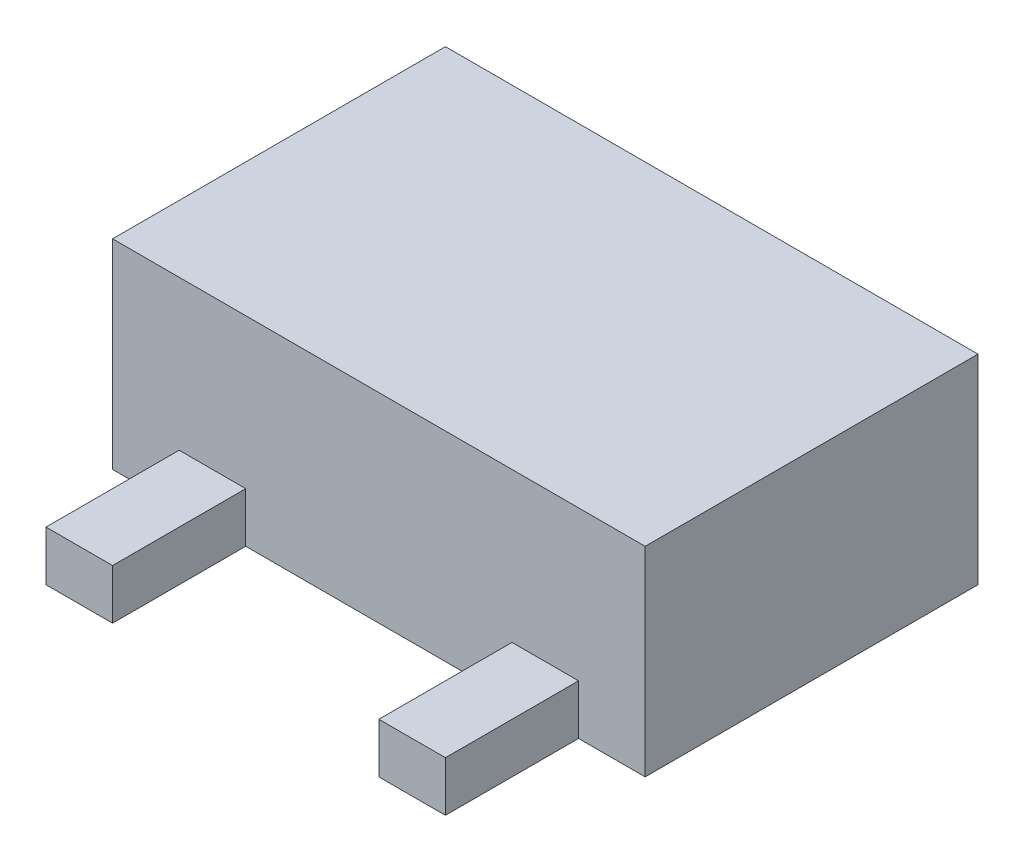
ISO-10303-21;
HEADER;
FILE_DESCRIPTION(('STEP AP214'),'2;1');
FILE_NAME('part.step','',(''),(''),'','','');
FILE_SCHEMA(('AUTOMOTIVE_DESIGN { 1 0 10303 214 1 1 1 1 }'));
ENDSEC;
DATA;
#1=APPLICATION_CONTEXT('core data for automotive mechanical design processes');
#2=APPLICATION_PROTOCOL_DEFINITION('international standard','automotive_design',2000,#1);
#3=PRODUCT_CONTEXT('',#1,'mechanical');
#4=PRODUCT('Part','Part','',(#3));
#5=PRODUCT_RELATED_PRODUCT_CATEGORY('part','',(#4));
#6=PRODUCT_DEFINITION_FORMATION('','',#4);
#7=PRODUCT_DEFINITION_CONTEXT('part definition',#1,'design');
#8=PRODUCT_DEFINITION('design','',#6,#7);
#9=PRODUCT_DEFINITION_SHAPE('','',#8);
#10=(LENGTH_UNIT() NAMED_UNIT(*) SI_UNIT(.MILLI.,.METRE.));
#11=(NAMED_UNIT(*) PLANE_ANGLE_UNIT() SI_UNIT($,.RADIAN.));
#12=(NAMED_UNIT(*) SI_UNIT($,.STERADIAN.) SOLID_ANGLE_UNIT());
#13=UNCERTAINTY_MEASURE_WITH_UNIT(LENGTH_MEASURE(1.E-05),#10,'distance_accuracy_value','');
#14=(GEOMETRIC_REPRESENTATION_CONTEXT(3) GLOBAL_UNCERTAINTY_ASSIGNED_CONTEXT((#13)) GLOBAL_UNIT_ASSIGNED_CONTEXT((#10,
#11,#12)) REPRESENTATION_CONTEXT('',''));
#15=CARTESIAN_POINT('',(0.,0.,0.));
#16=DIRECTION('',(0.,0.,1.));
#17=DIRECTION('',(1.,0.,0.));
#18=AXIS2_PLACEMENT_3D('',#15,#16,#17);
#19=CARTESIAN_POINT('',(-0.8,0.6,0.5));
#20=DIRECTION('',(0.,0.,-1.));
#21=DIRECTION('',(-1.,0.,0.));
#22=AXIS2_PLACEMENT_3D('',#19,#20,#21);
#23=PLANE('',#22);
#24=DIRECTION('',(-1.,0.,0.));
#25=VECTOR('',#24,1.);
#26=CARTESIAN_POINT('',(0.6,0.15,0.5));
#27=LINE('',#26,#25);
#28=CARTESIAN_POINT('',(0.6,0.15,0.5));
#29=VERTEX_POINT('',#28);
#30=CARTESIAN_POINT('',(0.4,0.15,0.5));
#31=VERTEX_POINT('',#30);
#32=EDGE_CURVE('E64',#29,#31,#27,.T.);
#33=ORIENTED_EDGE('',*,*,#32,.F.);
#34=DIRECTION('',(0.,-1.,0.));
#35=VECTOR('',#34,1.);
#36=CARTESIAN_POINT('',(0.6,0.597213595499958,0.5));
#37=LINE('',#36,#35);
#38=CARTESIAN_POINT('',(0.6,0.,0.5));
#39=VERTEX_POINT('',#38);
#40=EDGE_CURVE('E172',#29,#39,#37,.T.);
#41=ORIENTED_EDGE('',*,*,#40,.T.);
#42=DIRECTION('',(1.,0.,0.));
#43=VECTOR('',#42,1.);
#44=CARTESIAN_POINT('',(-0.8,0.,0.5));
#45=LINE('',#44,#43);
#46=CARTESIAN_POINT('',(0.8,0.,0.5));
#47=VERTEX_POINT('',#46);
#48=EDGE_CURVE('E157',#39,#47,#45,.T.);
#49=ORIENTED_EDGE('',*,*,#48,.T.);
#50=DIRECTION('',(0.,-1.,0.));
#51=VECTOR('',#50,1.);
#52=CARTESIAN_POINT('',(0.8,0.6,0.5));
#53=LINE('',#52,#51);
#54=CARTESIAN_POINT('',(0.8,0.6,0.5));
#55=VERTEX_POINT('',#54);
#56=EDGE_CURVE('E259',#55,#47,#53,.T.);
#57=ORIENTED_EDGE('',*,*,#56,.F.);
#58=DIRECTION('',(1.,0.,0.));
#59=VECTOR('',#58,1.);
#60=CARTESIAN_POINT('',(-0.8,0.6,0.5));
#61=LINE('',#60,#59);
#62=CARTESIAN_POINT('',(-0.8,0.6,0.5));
#63=VERTEX_POINT('',#62);
#64=EDGE_CURVE('E257',#63,#55,#61,.T.);
#65=ORIENTED_EDGE('',*,*,#64,.F.);
#66=DIRECTION('',(0.,-1.,0.));
#67=VECTOR('',#66,1.);
#68=CARTESIAN_POINT('',(-0.8,0.6,0.5));
#69=LINE('',#68,#67);
#70=CARTESIAN_POINT('',(-0.8,0.,0.5));
#71=VERTEX_POINT('',#70);
#72=EDGE_CURVE('E268',#63,#71,#69,.T.);
#73=ORIENTED_EDGE('',*,*,#72,.T.);
#74=CARTESIAN_POINT('',(-0.6,0.,0.5));
#75=VERTEX_POINT('',#74);
#76=EDGE_CURVE('E170',#71,#75,#45,.T.);
#77=ORIENTED_EDGE('',*,*,#76,.T.);
#78=DIRECTION('',(0.,-1.,0.));
#79=VECTOR('',#78,1.);
#80=CARTESIAN_POINT('',(-0.6,0.597213595499958,0.5));
#81=LINE('',#80,#79);
#82=CARTESIAN_POINT('',(-0.6,0.15,0.5));
#83=VERTEX_POINT('',#82);
#84=EDGE_CURVE('E215',#83,#75,#81,.T.);
#85=ORIENTED_EDGE('',*,*,#84,.F.);
#86=DIRECTION('',(1.,0.,0.));
#87=VECTOR('',#86,1.);
#88=CARTESIAN_POINT('',(-0.6,0.15,0.5));
#89=LINE('',#88,#87);
#90=CARTESIAN_POINT('',(-0.4,0.15,0.5));
#91=VERTEX_POINT('',#90);
#92=EDGE_CURVE('E201',#83,#91,#89,.T.);
#93=ORIENTED_EDGE('',*,*,#92,.T.);
#94=DIRECTION('',(0.,-1.,0.));
#95=VECTOR('',#94,1.);
#96=CARTESIAN_POINT('',(-0.4,0.597213595499958,0.5));
#97=LINE('',#96,#95);
#98=CARTESIAN_POINT('',(-0.4,0.,0.5));
#99=VERTEX_POINT('',#98);
#100=EDGE_CURVE('E217',#91,#99,#97,.T.);
#101=ORIENTED_EDGE('',*,*,#100,.T.);
#102=CARTESIAN_POINT('',(0.4,0.,0.5));
#103=VERTEX_POINT('',#102);
#104=EDGE_CURVE('E167',#99,#103,#45,.T.);
#105=ORIENTED_EDGE('',*,*,#104,.T.);
#106=DIRECTION('',(0.,-1.,0.));
#107=VECTOR('',#106,1.);
#108=CARTESIAN_POINT('',(0.4,0.597213595499958,0.5));
#109=LINE('',#108,#107);
#110=EDGE_CURVE('E60',#31,#103,#109,.T.);
#111=ORIENTED_EDGE('',*,*,#110,.F.);
#112=EDGE_LOOP('',(#33,#41,#49,#57,#65,#73,#77,#85,#93,#101,#105,#111));
#113=FACE_BOUND('',#112,.T.);
#114=ADVANCED_FACE('F45',(#113),#23,.F.);
#115=CARTESIAN_POINT('',(-0.8,0.6,-0.5));
#116=DIRECTION('',(0.,0.,1.));
#117=DIRECTION('',(1.,0.,0.));
#118=AXIS2_PLACEMENT_3D('',#115,#116,#117);
#119=PLANE('',#118);
#120=DIRECTION('',(0.,-1.,0.));
#121=VECTOR('',#120,1.);
#122=CARTESIAN_POINT('',(0.1,0.15,-0.500000000000001));
#123=LINE('',#122,#121);
#124=CARTESIAN_POINT('',(0.1,0.15,-0.500000000000001));
#125=VERTEX_POINT('',#124);
#126=CARTESIAN_POINT('',(0.1,0.,-0.500000000000001));
#127=VERTEX_POINT('',#126);
#128=EDGE_CURVE('E245',#125,#127,#123,.T.);
#129=ORIENTED_EDGE('',*,*,#128,.F.);
#130=DIRECTION('',(1.,0.,0.));
#131=VECTOR('',#130,1.);
#132=CARTESIAN_POINT('',(-0.1,0.15,-0.500000000000001));
#133=LINE('',#132,#131);
#134=CARTESIAN_POINT('',(-0.1,0.15,-0.500000000000001));
#135=VERTEX_POINT('',#134);
#136=EDGE_CURVE('E228',#135,#125,#133,.T.);
#137=ORIENTED_EDGE('',*,*,#136,.F.);
#138=DIRECTION('',(0.,-1.,0.));
#139=VECTOR('',#138,1.);
#140=CARTESIAN_POINT('',(-0.1,0.15,-0.500000000000001));
#141=LINE('',#140,#139);
#142=CARTESIAN_POINT('',(-0.1,0.,-0.5));
#143=VERTEX_POINT('',#142);
#144=EDGE_CURVE('E247',#135,#143,#141,.T.);
#145=ORIENTED_EDGE('',*,*,#144,.T.);
#146=DIRECTION('',(-1.,0.,0.));
#147=VECTOR('',#146,1.);
#148=CARTESIAN_POINT('',(-0.8,0.,-0.5));
#149=LINE('',#148,#147);
#150=CARTESIAN_POINT('',(-0.8,0.,-0.5));
#151=VERTEX_POINT('',#150);
#152=EDGE_CURVE('E261',#143,#151,#149,.T.);
#153=ORIENTED_EDGE('',*,*,#152,.T.);
#154=DIRECTION('',(0.,-1.,0.));
#155=VECTOR('',#154,1.);
#156=CARTESIAN_POINT('',(-0.8,0.6,-0.5));
#157=LINE('',#156,#155);
#158=CARTESIAN_POINT('',(-0.8,0.6,-0.5));
#159=VERTEX_POINT('',#158);
#160=EDGE_CURVE('E53',#159,#151,#157,.T.);
#161=ORIENTED_EDGE('',*,*,#160,.F.);
#162=DIRECTION('',(-1.,0.,0.));
#163=VECTOR('',#162,1.);
#164=CARTESIAN_POINT('',(-0.8,0.6,-0.5));
#165=LINE('',#164,#163);
#166=CARTESIAN_POINT('',(0.8,0.6,-0.5));
#167=VERTEX_POINT('',#166);
#168=EDGE_CURVE('E253',#167,#159,#165,.T.);
#169=ORIENTED_EDGE('',*,*,#168,.F.);
#170=DIRECTION('',(0.,-1.,0.));
#171=VECTOR('',#170,1.);
#172=CARTESIAN_POINT('',(0.8,0.6,-0.5));
#173=LINE('',#172,#171);
#174=CARTESIAN_POINT('',(0.8,0.,-0.5));
#175=VERTEX_POINT('',#174);
#176=EDGE_CURVE('E11',#167,#175,#173,.T.);
#177=ORIENTED_EDGE('',*,*,#176,.T.);
#178=EDGE_CURVE('E262',#175,#127,#149,.T.);
#179=ORIENTED_EDGE('',*,*,#178,.T.);
#180=EDGE_LOOP('',(#129,#137,#145,#153,#161,#169,#177,#179));
#181=FACE_BOUND('',#180,.T.);
#182=ADVANCED_FACE('F290',(#181),#119,.F.);
#183=CARTESIAN_POINT('',(0.8,0.6,-0.5));
#184=DIRECTION('',(-1.,0.,0.));
#185=DIRECTION('',(0.,0.,1.));
#186=AXIS2_PLACEMENT_3D('',#183,#184,#185);
#187=PLANE('',#186);
#188=DIRECTION('',(0.,0.,-1.));
#189=VECTOR('',#188,1.);
#190=CARTESIAN_POINT('',(0.8,0.,-0.5));
#191=LINE('',#190,#189);
#192=EDGE_CURVE('E164',#47,#175,#191,.T.);
#193=ORIENTED_EDGE('',*,*,#192,.T.);
#194=ORIENTED_EDGE('',*,*,#176,.F.);
#195=DIRECTION('',(0.,0.,-1.));
#196=VECTOR('',#195,1.);
#197=CARTESIAN_POINT('',(0.8,0.6,-0.5));
#198=LINE('',#197,#196);
#199=EDGE_CURVE('E250',#55,#167,#198,.T.);
#200=ORIENTED_EDGE('',*,*,#199,.F.);
#201=ORIENTED_EDGE('',*,*,#56,.T.);
#202=EDGE_LOOP('',(#193,#194,#200,#201));
#203=FACE_BOUND('',#202,.T.);
#204=ADVANCED_FACE('F47',(#203),#187,.F.);
#205=CARTESIAN_POINT('',(-0.8,0.6,-0.5));
#206=DIRECTION('',(1.,0.,0.));
#207=DIRECTION('',(0.,0.,-1.));
#208=AXIS2_PLACEMENT_3D('',#205,#206,#207);
#209=PLANE('',#208);
#210=DIRECTION('',(0.,0.,1.));
#211=VECTOR('',#210,1.);
#212=CARTESIAN_POINT('',(-0.8,0.,-0.5));
#213=LINE('',#212,#211);
#214=EDGE_CURVE('E168',#151,#71,#213,.T.);
#215=ORIENTED_EDGE('',*,*,#214,.T.);
#216=ORIENTED_EDGE('',*,*,#72,.F.);
#217=DIRECTION('',(0.,0.,1.));
#218=VECTOR('',#217,1.);
#219=CARTESIAN_POINT('',(-0.8,0.6,-0.5));
#220=LINE('',#219,#218);
#221=EDGE_CURVE('E255',#159,#63,#220,.T.);
#222=ORIENTED_EDGE('',*,*,#221,.F.);
#223=ORIENTED_EDGE('',*,*,#160,.T.);
#224=EDGE_LOOP('',(#215,#216,#222,#223));
#225=FACE_BOUND('',#224,.T.);
#226=ADVANCED_FACE('F275',(#225),#209,.F.);
#227=CARTESIAN_POINT('',(0.,0.6,0.));
#228=DIRECTION('',(0.,1.,0.));
#229=DIRECTION('',(0.,0.,1.));
#230=AXIS2_PLACEMENT_3D('',#227,#228,#229);
#231=PLANE('',#230);
#232=ORIENTED_EDGE('',*,*,#199,.T.);
#233=ORIENTED_EDGE('',*,*,#168,.T.);
#234=ORIENTED_EDGE('',*,*,#221,.T.);
#235=ORIENTED_EDGE('',*,*,#64,.T.);
#236=EDGE_LOOP('',(#232,#233,#234,#235));
#237=FACE_BOUND('',#236,.T.);
#238=ADVANCED_FACE('F287',(#237),#231,.T.);
#239=CARTESIAN_POINT('',(0.,0.,0.));
#240=DIRECTION('',(0.,1.,0.));
#241=DIRECTION('',(0.,0.,1.));
#242=AXIS2_PLACEMENT_3D('',#239,#240,#241);
#243=PLANE('',#242);
#244=ORIENTED_EDGE('',*,*,#192,.F.);
#245=ORIENTED_EDGE('',*,*,#48,.F.);
#246=DIRECTION('',(0.,0.,1.));
#247=VECTOR('',#246,1.);
#248=CARTESIAN_POINT('',(0.6,0.,0.5));
#249=LINE('',#248,#247);
#250=CARTESIAN_POINT('',(0.6,0.,0.9));
#251=VERTEX_POINT('',#250);
#252=EDGE_CURVE('E161',#39,#251,#249,.T.);
#253=ORIENTED_EDGE('',*,*,#252,.T.);
#254=DIRECTION('',(-1.,0.,0.));
#255=VECTOR('',#254,1.);
#256=CARTESIAN_POINT('',(0.6,0.,0.9));
#257=LINE('',#256,#255);
#258=CARTESIAN_POINT('',(0.4,0.,0.9));
#259=VERTEX_POINT('',#258);
#260=EDGE_CURVE('E183',#251,#259,#257,.T.);
#261=ORIENTED_EDGE('',*,*,#260,.T.);
#262=DIRECTION('',(0.,0.,-1.));
#263=VECTOR('',#262,1.);
#264=CARTESIAN_POINT('',(0.4,0.,0.5));
#265=LINE('',#264,#263);
#266=EDGE_CURVE('E180',#259,#103,#265,.T.);
#267=ORIENTED_EDGE('',*,*,#266,.T.);
#268=ORIENTED_EDGE('',*,*,#104,.F.);
#269=DIRECTION('',(0.,0.,-1.));
#270=VECTOR('',#269,1.);
#271=CARTESIAN_POINT('',(-0.4,0.,0.5));
#272=LINE('',#271,#270);
#273=CARTESIAN_POINT('',(-0.4,0.,0.9));
#274=VERTEX_POINT('',#273);
#275=EDGE_CURVE('E213',#274,#99,#272,.T.);
#276=ORIENTED_EDGE('',*,*,#275,.F.);
#277=DIRECTION('',(1.,0.,0.));
#278=VECTOR('',#277,1.);
#279=CARTESIAN_POINT('',(-0.6,0.,0.9));
#280=LINE('',#279,#278);
#281=CARTESIAN_POINT('',(-0.6,0.,0.9));
#282=VERTEX_POINT('',#281);
#283=EDGE_CURVE('E210',#282,#274,#280,.T.);
#284=ORIENTED_EDGE('',*,*,#283,.F.);
#285=DIRECTION('',(0.,0.,1.));
#286=VECTOR('',#285,1.);
#287=CARTESIAN_POINT('',(-0.6,0.,0.5));
#288=LINE('',#287,#286);
#289=EDGE_CURVE('E196',#75,#282,#288,.T.);
#290=ORIENTED_EDGE('',*,*,#289,.F.);
#291=ORIENTED_EDGE('',*,*,#76,.F.);
#292=ORIENTED_EDGE('',*,*,#214,.F.);
#293=ORIENTED_EDGE('',*,*,#152,.F.);
#294=DIRECTION('',(0.,0.,1.));
#295=VECTOR('',#294,1.);
#296=CARTESIAN_POINT('',(-0.1,0.,-0.500000000000001));
#297=LINE('',#296,#295);
#298=CARTESIAN_POINT('',(-0.1,0.,-0.900000000000001));
#299=VERTEX_POINT('',#298);
#300=EDGE_CURVE('E207',#299,#143,#297,.T.);
#301=ORIENTED_EDGE('',*,*,#300,.F.);
#302=DIRECTION('',(-1.,0.,0.));
#303=VECTOR('',#302,1.);
#304=CARTESIAN_POINT('',(-0.1,0.,-0.900000000000001));
#305=LINE('',#304,#303);
#306=CARTESIAN_POINT('',(0.1,0.,-0.9));
#307=VERTEX_POINT('',#306);
#308=EDGE_CURVE('E229',#307,#299,#305,.T.);
#309=ORIENTED_EDGE('',*,*,#308,.F.);
#310=DIRECTION('',(0.,0.,-1.));
#311=VECTOR('',#310,1.);
#312=CARTESIAN_POINT('',(0.1,0.,-0.500000000000001));
#313=LINE('',#312,#311);
#314=EDGE_CURVE('E237',#127,#307,#313,.T.);
#315=ORIENTED_EDGE('',*,*,#314,.F.);
#316=ORIENTED_EDGE('',*,*,#178,.F.);
#317=EDGE_LOOP('',(#244,#245,#253,#261,#267,#268,#276,#284,#290,#291,#292,#293,#301,#309,#315,#316));
#318=FACE_BOUND('',#317,.T.);
#319=ADVANCED_FACE('F158',(#318),#243,.F.);
#320=CARTESIAN_POINT('',(-0.1,0.15,-0.500000000000001));
#321=DIRECTION('',(1.,0.,0.));
#322=DIRECTION('',(0.,0.,-1.));
#323=AXIS2_PLACEMENT_3D('',#320,#321,#322);
#324=PLANE('',#323);
#325=ORIENTED_EDGE('',*,*,#300,.T.);
#326=ORIENTED_EDGE('',*,*,#144,.F.);
#327=DIRECTION('',(0.,0.,1.));
#328=VECTOR('',#327,1.);
#329=CARTESIAN_POINT('',(-0.1,0.15,-0.500000000000001));
#330=LINE('',#329,#328);
#331=CARTESIAN_POINT('',(-0.1,0.15,-0.900000000000001));
#332=VERTEX_POINT('',#331);
#333=EDGE_CURVE('E226',#332,#135,#330,.T.);
#334=ORIENTED_EDGE('',*,*,#333,.F.);
#335=DIRECTION('',(0.,-1.,0.));
#336=VECTOR('',#335,1.);
#337=CARTESIAN_POINT('',(-0.1,0.15,-0.900000000000001));
#338=LINE('',#337,#336);
#339=EDGE_CURVE('E235',#332,#299,#338,.T.);
#340=ORIENTED_EDGE('',*,*,#339,.T.);
#341=EDGE_LOOP('',(#325,#326,#334,#340));
#342=FACE_BOUND('',#341,.T.);
#343=ADVANCED_FACE('F305',(#342),#324,.F.);
#344=CARTESIAN_POINT('',(0.1,0.15,-0.500000000000001));
#345=DIRECTION('',(-1.,0.,0.));
#346=DIRECTION('',(0.,0.,1.));
#347=AXIS2_PLACEMENT_3D('',#344,#345,#346);
#348=PLANE('',#347);
#349=ORIENTED_EDGE('',*,*,#314,.T.);
#350=DIRECTION('',(0.,-1.,0.));
#351=VECTOR('',#350,1.);
#352=CARTESIAN_POINT('',(0.1,0.15,-0.9));
#353=LINE('',#352,#351);
#354=CARTESIAN_POINT('',(0.1,0.15,-0.9));
#355=VERTEX_POINT('',#354);
#356=EDGE_CURVE('E242',#355,#307,#353,.T.);
#357=ORIENTED_EDGE('',*,*,#356,.F.);
#358=DIRECTION('',(0.,0.,-1.));
#359=VECTOR('',#358,1.);
#360=CARTESIAN_POINT('',(0.1,0.15,-0.500000000000001));
#361=LINE('',#360,#359);
#362=EDGE_CURVE('E231',#125,#355,#361,.T.);
#363=ORIENTED_EDGE('',*,*,#362,.F.);
#364=ORIENTED_EDGE('',*,*,#128,.T.);
#365=EDGE_LOOP('',(#349,#357,#363,#364));
#366=FACE_BOUND('',#365,.T.);
#367=ADVANCED_FACE('F310',(#366),#348,.F.);
#368=CARTESIAN_POINT('',(-0.1,0.15,-0.900000000000001));
#369=DIRECTION('',(0.,0.,1.));
#370=DIRECTION('',(1.,0.,0.));
#371=AXIS2_PLACEMENT_3D('',#368,#369,#370);
#372=PLANE('',#371);
#373=ORIENTED_EDGE('',*,*,#308,.T.);
#374=ORIENTED_EDGE('',*,*,#339,.F.);
#375=DIRECTION('',(-1.,0.,0.));
#376=VECTOR('',#375,1.);
#377=CARTESIAN_POINT('',(-0.1,0.15,-0.900000000000001));
#378=LINE('',#377,#376);
#379=EDGE_CURVE('E233',#355,#332,#378,.T.);
#380=ORIENTED_EDGE('',*,*,#379,.F.);
#381=ORIENTED_EDGE('',*,*,#356,.T.);
#382=EDGE_LOOP('',(#373,#374,#380,#381));
#383=FACE_BOUND('',#382,.T.);
#384=ADVANCED_FACE('F314',(#383),#372,.F.);
#385=CARTESIAN_POINT('',(0.,0.15,0.));
#386=DIRECTION('',(0.,-1.,0.));
#387=DIRECTION('',(0.,0.,-1.));
#388=AXIS2_PLACEMENT_3D('',#385,#386,#387);
#389=PLANE('',#388);
#390=ORIENTED_EDGE('',*,*,#333,.T.);
#391=ORIENTED_EDGE('',*,*,#136,.T.);
#392=ORIENTED_EDGE('',*,*,#362,.T.);
#393=ORIENTED_EDGE('',*,*,#379,.T.);
#394=EDGE_LOOP('',(#390,#391,#392,#393));
#395=FACE_BOUND('',#394,.T.);
#396=ADVANCED_FACE('F318',(#395),#389,.F.);
#397=CARTESIAN_POINT('',(-0.4,0.597213595499958,0.5));
#398=DIRECTION('',(-1.,0.,0.));
#399=DIRECTION('',(0.,0.,1.));
#400=AXIS2_PLACEMENT_3D('',#397,#398,#399);
#401=PLANE('',#400);
#402=ORIENTED_EDGE('',*,*,#100,.F.);
#403=DIRECTION('',(0.,0.,1.));
#404=VECTOR('',#403,1.);
#405=CARTESIAN_POINT('',(-0.4,0.15,0.5));
#406=LINE('',#405,#404);
#407=CARTESIAN_POINT('',(-0.4,0.15,0.9));
#408=VERTEX_POINT('',#407);
#409=EDGE_CURVE('E197',#91,#408,#406,.T.);
#410=ORIENTED_EDGE('',*,*,#409,.T.);
#411=DIRECTION('',(0.,-1.,0.));
#412=VECTOR('',#411,1.);
#413=CARTESIAN_POINT('',(-0.4,0.597213595499958,0.9));
#414=LINE('',#413,#412);
#415=EDGE_CURVE('E220',#408,#274,#414,.T.);
#416=ORIENTED_EDGE('',*,*,#415,.T.);
#417=ORIENTED_EDGE('',*,*,#275,.T.);
#418=EDGE_LOOP('',(#402,#410,#416,#417));
#419=FACE_BOUND('',#418,.T.);
#420=ADVANCED_FACE('F322',(#419),#401,.F.);
#421=CARTESIAN_POINT('',(-0.6,0.597213595499958,0.9));
#422=DIRECTION('',(0.,0.,-1.));
#423=DIRECTION('',(-1.,0.,0.));
#424=AXIS2_PLACEMENT_3D('',#421,#422,#423);
#425=PLANE('',#424);
#426=ORIENTED_EDGE('',*,*,#415,.F.);
#427=DIRECTION('',(-1.,0.,0.));
#428=VECTOR('',#427,1.);
#429=CARTESIAN_POINT('',(-0.6,0.15,0.9));
#430=LINE('',#429,#428);
#431=CARTESIAN_POINT('',(-0.6,0.15,0.9));
#432=VERTEX_POINT('',#431);
#433=EDGE_CURVE('E200',#408,#432,#430,.T.);
#434=ORIENTED_EDGE('',*,*,#433,.T.);
#435=DIRECTION('',(0.,-1.,0.));
#436=VECTOR('',#435,1.);
#437=CARTESIAN_POINT('',(-0.6,0.597213595499958,0.9));
#438=LINE('',#437,#436);
#439=EDGE_CURVE('E222',#432,#282,#438,.T.);
#440=ORIENTED_EDGE('',*,*,#439,.T.);
#441=ORIENTED_EDGE('',*,*,#283,.T.);
#442=EDGE_LOOP('',(#426,#434,#440,#441));
#443=FACE_BOUND('',#442,.T.);
#444=ADVANCED_FACE('F328',(#443),#425,.F.);
#445=CARTESIAN_POINT('',(-0.6,0.597213595499958,0.5));
#446=DIRECTION('',(1.,0.,0.));
#447=DIRECTION('',(0.,0.,-1.));
#448=AXIS2_PLACEMENT_3D('',#445,#446,#447);
#449=PLANE('',#448);
#450=ORIENTED_EDGE('',*,*,#439,.F.);
#451=DIRECTION('',(0.,0.,-1.));
#452=VECTOR('',#451,1.);
#453=CARTESIAN_POINT('',(-0.6,0.15,0.5));
#454=LINE('',#453,#452);
#455=EDGE_CURVE('E204',#432,#83,#454,.T.);
#456=ORIENTED_EDGE('',*,*,#455,.T.);
#457=ORIENTED_EDGE('',*,*,#84,.T.);
#458=ORIENTED_EDGE('',*,*,#289,.T.);
#459=EDGE_LOOP('',(#450,#456,#457,#458));
#460=FACE_BOUND('',#459,.T.);
#461=ADVANCED_FACE('F324',(#460),#449,.F.);
#462=CARTESIAN_POINT('',(0.,0.15,0.));
#463=DIRECTION('',(0.,-1.,0.));
#464=DIRECTION('',(0.,0.,-1.));
#465=AXIS2_PLACEMENT_3D('',#462,#463,#464);
#466=PLANE('',#465);
#467=ORIENTED_EDGE('',*,*,#433,.F.);
#468=ORIENTED_EDGE('',*,*,#409,.F.);
#469=ORIENTED_EDGE('',*,*,#92,.F.);
#470=ORIENTED_EDGE('',*,*,#455,.F.);
#471=EDGE_LOOP('',(#467,#468,#469,#470));
#472=FACE_BOUND('',#471,.T.);
#473=ADVANCED_FACE('F327',(#472),#466,.F.);
#474=CARTESIAN_POINT('',(0.6,0.597213595499958,0.5));
#475=DIRECTION('',(1.,0.,0.));
#476=DIRECTION('',(0.,0.,-1.));
#477=AXIS2_PLACEMENT_3D('',#474,#475,#476);
#478=PLANE('',#477);
#479=DIRECTION('',(0.,0.,-1.));
#480=VECTOR('',#479,1.);
#481=CARTESIAN_POINT('',(0.6,0.15,0.5));
#482=LINE('',#481,#480);
#483=CARTESIAN_POINT('',(0.6,0.15,0.9));
#484=VERTEX_POINT('',#483);
#485=EDGE_CURVE('E186',#484,#29,#482,.T.);
#486=ORIENTED_EDGE('',*,*,#485,.F.);
#487=DIRECTION('',(0.,-1.,0.));
#488=VECTOR('',#487,1.);
#489=CARTESIAN_POINT('',(0.6,0.597213595499958,0.9));
#490=LINE('',#489,#488);
#491=EDGE_CURVE('E179',#484,#251,#490,.T.);
#492=ORIENTED_EDGE('',*,*,#491,.T.);
#493=ORIENTED_EDGE('',*,*,#252,.F.);
#494=ORIENTED_EDGE('',*,*,#40,.F.);
#495=EDGE_LOOP('',(#486,#492,#493,#494));
#496=FACE_BOUND('',#495,.T.);
#497=ADVANCED_FACE('F177',(#496),#478,.T.);
#498=CARTESIAN_POINT('',(0.4,0.597213595499958,0.5));
#499=DIRECTION('',(-1.,0.,0.));
#500=DIRECTION('',(0.,0.,1.));
#501=AXIS2_PLACEMENT_3D('',#498,#499,#500);
#502=PLANE('',#501);
#503=DIRECTION('',(0.,0.,1.));
#504=VECTOR('',#503,1.);
#505=CARTESIAN_POINT('',(0.4,0.15,0.5));
#506=LINE('',#505,#504);
#507=CARTESIAN_POINT('',(0.4,0.15,0.9));
#508=VERTEX_POINT('',#507);
#509=EDGE_CURVE('E175',#31,#508,#506,.T.);
#510=ORIENTED_EDGE('',*,*,#509,.F.);
#511=ORIENTED_EDGE('',*,*,#110,.T.);
#512=ORIENTED_EDGE('',*,*,#266,.F.);
#513=DIRECTION('',(0.,-1.,0.));
#514=VECTOR('',#513,1.);
#515=CARTESIAN_POINT('',(0.4,0.597213595499958,0.9));
#516=LINE('',#515,#514);
#517=EDGE_CURVE('E191',#508,#259,#516,.T.);
#518=ORIENTED_EDGE('',*,*,#517,.F.);
#519=EDGE_LOOP('',(#510,#511,#512,#518));
#520=FACE_BOUND('',#519,.T.);
#521=ADVANCED_FACE('F341',(#520),#502,.T.);
#522=CARTESIAN_POINT('',(0.6,0.597213595499958,0.9));
#523=DIRECTION('',(0.,0.,1.));
#524=DIRECTION('',(1.,0.,0.));
#525=AXIS2_PLACEMENT_3D('',#522,#523,#524);
#526=PLANE('',#525);
#527=DIRECTION('',(1.,0.,0.));
#528=VECTOR('',#527,1.);
#529=CARTESIAN_POINT('',(0.6,0.15,0.9));
#530=LINE('',#529,#528);
#531=EDGE_CURVE('E194',#508,#484,#530,.T.);
#532=ORIENTED_EDGE('',*,*,#531,.F.);
#533=ORIENTED_EDGE('',*,*,#517,.T.);
#534=ORIENTED_EDGE('',*,*,#260,.F.);
#535=ORIENTED_EDGE('',*,*,#491,.F.);
#536=EDGE_LOOP('',(#532,#533,#534,#535));
#537=FACE_BOUND('',#536,.T.);
#538=ADVANCED_FACE('F344',(#537),#526,.T.);
#539=CARTESIAN_POINT('',(0.,0.15,0.));
#540=DIRECTION('',(0.,-1.,0.));
#541=DIRECTION('',(0.,0.,-1.));
#542=AXIS2_PLACEMENT_3D('',#539,#540,#541);
#543=PLANE('',#542);
#544=ORIENTED_EDGE('',*,*,#485,.T.);
#545=ORIENTED_EDGE('',*,*,#32,.T.);
#546=ORIENTED_EDGE('',*,*,#509,.T.);
#547=ORIENTED_EDGE('',*,*,#531,.T.);
#548=EDGE_LOOP('',(#544,#545,#546,#547));
#549=FACE_BOUND('',#548,.T.);
#550=ADVANCED_FACE('F348',(#549),#543,.F.);
#551=CLOSED_SHELL('',(#114,#182,#204,#226,#238,#319,#343,#367,#384,#396,#420,#444,#461,#473,
#497,#521,#538,#550));
#552=MANIFOLD_SOLID_BREP('B2',#551);
#553=ADVANCED_BREP_SHAPE_REPRESENTATION('',(#18,#552),#14);
#554=SHAPE_DEFINITION_REPRESENTATION(#9,#553);
ENDSEC;
END-ISO-10303-21;
